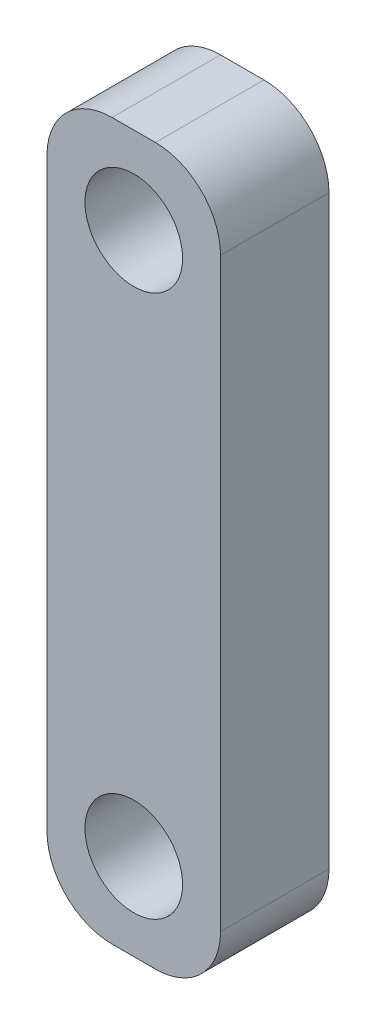
ISO-10303-21;
HEADER;
FILE_DESCRIPTION(('STEP AP214'),'2;1');
FILE_NAME('part.step','',(''),(''),'','','');
FILE_SCHEMA(('AUTOMOTIVE_DESIGN { 1 0 10303 214 1 1 1 1 }'));
ENDSEC;
DATA;
#1=APPLICATION_CONTEXT('core data for automotive mechanical design processes');
#2=APPLICATION_PROTOCOL_DEFINITION('international standard','automotive_design',2000,#1);
#3=PRODUCT_CONTEXT('',#1,'mechanical');
#4=PRODUCT('Part','Part','',(#3));
#5=PRODUCT_RELATED_PRODUCT_CATEGORY('part','',(#4));
#6=PRODUCT_DEFINITION_FORMATION('','',#4);
#7=PRODUCT_DEFINITION_CONTEXT('part definition',#1,'design');
#8=PRODUCT_DEFINITION('design','',#6,#7);
#9=PRODUCT_DEFINITION_SHAPE('','',#8);
#10=(LENGTH_UNIT() NAMED_UNIT(*) SI_UNIT(.MILLI.,.METRE.));
#11=(NAMED_UNIT(*) PLANE_ANGLE_UNIT() SI_UNIT($,.RADIAN.));
#12=(NAMED_UNIT(*) SI_UNIT($,.STERADIAN.) SOLID_ANGLE_UNIT());
#13=UNCERTAINTY_MEASURE_WITH_UNIT(LENGTH_MEASURE(1.E-05),#10,'distance_accuracy_value','');
#14=(GEOMETRIC_REPRESENTATION_CONTEXT(3) GLOBAL_UNCERTAINTY_ASSIGNED_CONTEXT((#13)) GLOBAL_UNIT_ASSIGNED_CONTEXT((#10,
#11,#12)) REPRESENTATION_CONTEXT('',''));
#15=CARTESIAN_POINT('',(0.,0.,0.));
#16=DIRECTION('',(0.,0.,1.));
#17=DIRECTION('',(1.,0.,0.));
#18=AXIS2_PLACEMENT_3D('',#15,#16,#17);
#19=CARTESIAN_POINT('',(0.,0.,5.));
#20=DIRECTION('',(0.,0.,1.));
#21=DIRECTION('',(1.,0.,0.));
#22=AXIS2_PLACEMENT_3D('',#19,#20,#21);
#23=PLANE('',#22);
#24=CARTESIAN_POINT('',(4.,-29.,5.));
#25=DIRECTION('',(0.,0.,1.));
#26=DIRECTION('',(1.,0.,0.));
#27=AXIS2_PLACEMENT_3D('',#24,#25,#26);
#28=CIRCLE('',#27,2.24999999999998);
#29=CARTESIAN_POINT('',(6.24999999999998,-29.,5.));
#30=VERTEX_POINT('',#29);
#31=EDGE_CURVE('E130',#30,#30,#28,.T.);
#32=ORIENTED_EDGE('',*,*,#31,.F.);
#33=EDGE_LOOP('',(#32));
#34=FACE_BOUND('',#33,.T.);
#35=DIRECTION('',(0.,-1.,0.));
#36=VECTOR('',#35,1.);
#37=CARTESIAN_POINT('',(0.,0.,5.));
#38=LINE('',#37,#36);
#39=CARTESIAN_POINT('',(0.,-3.,5.));
#40=VERTEX_POINT('',#39);
#41=CARTESIAN_POINT('',(0.,-30.,5.));
#42=VERTEX_POINT('',#41);
#43=EDGE_CURVE('E135',#40,#42,#38,.T.);
#44=ORIENTED_EDGE('',*,*,#43,.T.);
#45=CARTESIAN_POINT('',(3.,-30.,5.));
#46=DIRECTION('',(0.,0.,1.));
#47=DIRECTION('',(1.,0.,0.));
#48=AXIS2_PLACEMENT_3D('',#45,#46,#47);
#49=CIRCLE('',#48,3.);
#50=CARTESIAN_POINT('',(3.,-33.,5.));
#51=VERTEX_POINT('',#50);
#52=EDGE_CURVE('E150',#42,#51,#49,.T.);
#53=ORIENTED_EDGE('',*,*,#52,.T.);
#54=DIRECTION('',(1.,0.,0.));
#55=VECTOR('',#54,1.);
#56=CARTESIAN_POINT('',(0.,-33.,5.));
#57=LINE('',#56,#55);
#58=CARTESIAN_POINT('',(5.00000000000001,-33.,5.));
#59=VERTEX_POINT('',#58);
#60=EDGE_CURVE('E117',#51,#59,#57,.T.);
#61=ORIENTED_EDGE('',*,*,#60,.T.);
#62=CARTESIAN_POINT('',(5.00000000000001,-30.,5.));
#63=DIRECTION('',(0.,0.,1.));
#64=DIRECTION('',(1.,0.,0.));
#65=AXIS2_PLACEMENT_3D('',#62,#63,#64);
#66=CIRCLE('',#65,3.);
#67=CARTESIAN_POINT('',(8.00000000000001,-30.,5.));
#68=VERTEX_POINT('',#67);
#69=EDGE_CURVE('E148',#59,#68,#66,.T.);
#70=ORIENTED_EDGE('',*,*,#69,.T.);
#71=DIRECTION('',(0.,1.,0.));
#72=VECTOR('',#71,1.);
#73=CARTESIAN_POINT('',(8.00000000000001,0.,5.));
#74=LINE('',#73,#72);
#75=CARTESIAN_POINT('',(8.00000000000001,-3.,5.));
#76=VERTEX_POINT('',#75);
#77=EDGE_CURVE('E170',#68,#76,#74,.T.);
#78=ORIENTED_EDGE('',*,*,#77,.T.);
#79=CARTESIAN_POINT('',(5.00000000000001,-3.,5.));
#80=DIRECTION('',(0.,0.,1.));
#81=DIRECTION('',(1.,0.,0.));
#82=AXIS2_PLACEMENT_3D('',#79,#80,#81);
#83=CIRCLE('',#82,3.);
#84=CARTESIAN_POINT('',(5.00000000000001,0.,5.));
#85=VERTEX_POINT('',#84);
#86=EDGE_CURVE('E52',#76,#85,#83,.T.);
#87=ORIENTED_EDGE('',*,*,#86,.T.);
#88=DIRECTION('',(-1.,0.,0.));
#89=VECTOR('',#88,1.);
#90=CARTESIAN_POINT('',(0.,0.,5.));
#91=LINE('',#90,#89);
#92=CARTESIAN_POINT('',(3.,0.,5.));
#93=VERTEX_POINT('',#92);
#94=EDGE_CURVE('E136',#85,#93,#91,.T.);
#95=ORIENTED_EDGE('',*,*,#94,.T.);
#96=CARTESIAN_POINT('',(3.,-3.,5.));
#97=DIRECTION('',(0.,0.,1.));
#98=DIRECTION('',(1.,0.,0.));
#99=AXIS2_PLACEMENT_3D('',#96,#97,#98);
#100=CIRCLE('',#99,3.);
#101=EDGE_CURVE('E146',#93,#40,#100,.T.);
#102=ORIENTED_EDGE('',*,*,#101,.T.);
#103=EDGE_LOOP('',(#44,#53,#61,#70,#78,#87,#95,#102));
#104=FACE_BOUND('',#103,.T.);
#105=CARTESIAN_POINT('',(4.,-4.,5.));
#106=DIRECTION('',(0.,0.,1.));
#107=DIRECTION('',(1.,0.,0.));
#108=AXIS2_PLACEMENT_3D('',#105,#106,#107);
#109=CIRCLE('',#108,2.25);
#110=CARTESIAN_POINT('',(6.25,-4.,5.));
#111=VERTEX_POINT('',#110);
#112=EDGE_CURVE('E182',#111,#111,#109,.T.);
#113=ORIENTED_EDGE('',*,*,#112,.F.);
#114=EDGE_LOOP('',(#113));
#115=FACE_BOUND('',#114,.T.);
#116=ADVANCED_FACE('F32',(#34,#104,#115),#23,.T.);
#117=CARTESIAN_POINT('',(0.,0.,0.));
#118=DIRECTION('',(0.,0.,1.));
#119=DIRECTION('',(1.,0.,0.));
#120=AXIS2_PLACEMENT_3D('',#117,#118,#119);
#121=PLANE('',#120);
#122=CARTESIAN_POINT('',(4.,-29.,0.));
#123=DIRECTION('',(0.,0.,1.));
#124=DIRECTION('',(1.,0.,0.));
#125=AXIS2_PLACEMENT_3D('',#122,#123,#124);
#126=CIRCLE('',#125,2.24999999999998);
#127=CARTESIAN_POINT('',(6.24999999999998,-29.,0.));
#128=VERTEX_POINT('',#127);
#129=EDGE_CURVE('E173',#128,#128,#126,.T.);
#130=ORIENTED_EDGE('',*,*,#129,.T.);
#131=EDGE_LOOP('',(#130));
#132=FACE_BOUND('',#131,.T.);
#133=DIRECTION('',(1.,0.,0.));
#134=VECTOR('',#133,1.);
#135=CARTESIAN_POINT('',(0.,-33.,0.));
#136=LINE('',#135,#134);
#137=CARTESIAN_POINT('',(3.,-33.,0.));
#138=VERTEX_POINT('',#137);
#139=CARTESIAN_POINT('',(5.00000000000001,-33.,0.));
#140=VERTEX_POINT('',#139);
#141=EDGE_CURVE('E114',#138,#140,#136,.T.);
#142=ORIENTED_EDGE('',*,*,#141,.F.);
#143=CARTESIAN_POINT('',(3.,-30.,0.));
#144=DIRECTION('',(0.,0.,1.));
#145=DIRECTION('',(1.,0.,0.));
#146=AXIS2_PLACEMENT_3D('',#143,#144,#145);
#147=CIRCLE('',#146,3.);
#148=CARTESIAN_POINT('',(0.,-30.,0.));
#149=VERTEX_POINT('',#148);
#150=EDGE_CURVE('E97',#138,#149,#147,.F.);
#151=ORIENTED_EDGE('',*,*,#150,.T.);
#152=DIRECTION('',(0.,-1.,0.));
#153=VECTOR('',#152,1.);
#154=CARTESIAN_POINT('',(0.,0.,0.));
#155=LINE('',#154,#153);
#156=CARTESIAN_POINT('',(0.,-3.,0.));
#157=VERTEX_POINT('',#156);
#158=EDGE_CURVE('E125',#157,#149,#155,.T.);
#159=ORIENTED_EDGE('',*,*,#158,.F.);
#160=CARTESIAN_POINT('',(3.,-3.,0.));
#161=DIRECTION('',(0.,0.,1.));
#162=DIRECTION('',(1.,0.,0.));
#163=AXIS2_PLACEMENT_3D('',#160,#161,#162);
#164=CIRCLE('',#163,3.);
#165=CARTESIAN_POINT('',(3.,0.,0.));
#166=VERTEX_POINT('',#165);
#167=EDGE_CURVE('E139',#157,#166,#164,.F.);
#168=ORIENTED_EDGE('',*,*,#167,.T.);
#169=DIRECTION('',(-1.,0.,0.));
#170=VECTOR('',#169,1.);
#171=CARTESIAN_POINT('',(0.,0.,0.));
#172=LINE('',#171,#170);
#173=CARTESIAN_POINT('',(5.00000000000001,0.,0.));
#174=VERTEX_POINT('',#173);
#175=EDGE_CURVE('E128',#174,#166,#172,.T.);
#176=ORIENTED_EDGE('',*,*,#175,.F.);
#177=CARTESIAN_POINT('',(5.00000000000001,-3.,0.));
#178=DIRECTION('',(0.,0.,1.));
#179=DIRECTION('',(1.,0.,0.));
#180=AXIS2_PLACEMENT_3D('',#177,#178,#179);
#181=CIRCLE('',#180,3.);
#182=CARTESIAN_POINT('',(8.00000000000001,-3.,0.));
#183=VERTEX_POINT('',#182);
#184=EDGE_CURVE('E118',#174,#183,#181,.F.);
#185=ORIENTED_EDGE('',*,*,#184,.T.);
#186=DIRECTION('',(0.,1.,0.));
#187=VECTOR('',#186,1.);
#188=CARTESIAN_POINT('',(8.00000000000001,0.,0.));
#189=LINE('',#188,#187);
#190=CARTESIAN_POINT('',(8.00000000000001,-30.,0.));
#191=VERTEX_POINT('',#190);
#192=EDGE_CURVE('E124',#191,#183,#189,.T.);
#193=ORIENTED_EDGE('',*,*,#192,.F.);
#194=CARTESIAN_POINT('',(5.00000000000001,-30.,0.));
#195=DIRECTION('',(0.,0.,1.));
#196=DIRECTION('',(1.,0.,0.));
#197=AXIS2_PLACEMENT_3D('',#194,#195,#196);
#198=CIRCLE('',#197,3.);
#199=EDGE_CURVE('E108',#191,#140,#198,.F.);
#200=ORIENTED_EDGE('',*,*,#199,.T.);
#201=EDGE_LOOP('',(#142,#151,#159,#168,#176,#185,#193,#200));
#202=FACE_BOUND('',#201,.T.);
#203=CARTESIAN_POINT('',(4.,-4.,0.));
#204=DIRECTION('',(0.,0.,1.));
#205=DIRECTION('',(1.,0.,0.));
#206=AXIS2_PLACEMENT_3D('',#203,#204,#205);
#207=CIRCLE('',#206,2.25);
#208=CARTESIAN_POINT('',(6.25,-4.,0.));
#209=VERTEX_POINT('',#208);
#210=EDGE_CURVE('E184',#209,#209,#207,.T.);
#211=ORIENTED_EDGE('',*,*,#210,.T.);
#212=EDGE_LOOP('',(#211));
#213=FACE_BOUND('',#212,.T.);
#214=ADVANCED_FACE('F121',(#132,#202,#213),#121,.F.);
#215=CARTESIAN_POINT('',(0.,0.,5.));
#216=DIRECTION('',(1.,0.,0.));
#217=DIRECTION('',(0.,0.,-1.));
#218=AXIS2_PLACEMENT_3D('',#215,#216,#217);
#219=PLANE('',#218);
#220=ORIENTED_EDGE('',*,*,#158,.T.);
#221=DIRECTION('',(0.,0.,-1.));
#222=VECTOR('',#221,1.);
#223=CARTESIAN_POINT('',(0.,-30.,5.));
#224=LINE('',#223,#222);
#225=EDGE_CURVE('E102',#149,#42,#224,.F.);
#226=ORIENTED_EDGE('',*,*,#225,.T.);
#227=ORIENTED_EDGE('',*,*,#43,.F.);
#228=DIRECTION('',(0.,0.,-1.));
#229=VECTOR('',#228,1.);
#230=CARTESIAN_POINT('',(0.,-3.,5.));
#231=LINE('',#230,#229);
#232=EDGE_CURVE('E107',#40,#157,#231,.T.);
#233=ORIENTED_EDGE('',*,*,#232,.T.);
#234=EDGE_LOOP('',(#220,#226,#227,#233));
#235=FACE_BOUND('',#234,.T.);
#236=ADVANCED_FACE('F167',(#235),#219,.F.);
#237=CARTESIAN_POINT('',(0.,-33.,5.));
#238=DIRECTION('',(0.,1.,0.));
#239=DIRECTION('',(0.,0.,1.));
#240=AXIS2_PLACEMENT_3D('',#237,#238,#239);
#241=PLANE('',#240);
#242=ORIENTED_EDGE('',*,*,#60,.F.);
#243=DIRECTION('',(0.,0.,-1.));
#244=VECTOR('',#243,1.);
#245=CARTESIAN_POINT('',(3.,-33.,5.));
#246=LINE('',#245,#244);
#247=EDGE_CURVE('E101',#51,#138,#246,.T.);
#248=ORIENTED_EDGE('',*,*,#247,.T.);
#249=ORIENTED_EDGE('',*,*,#141,.T.);
#250=DIRECTION('',(0.,0.,-1.));
#251=VECTOR('',#250,1.);
#252=CARTESIAN_POINT('',(5.00000000000001,-33.,5.));
#253=LINE('',#252,#251);
#254=EDGE_CURVE('E119',#140,#59,#253,.F.);
#255=ORIENTED_EDGE('',*,*,#254,.T.);
#256=EDGE_LOOP('',(#242,#248,#249,#255));
#257=FACE_BOUND('',#256,.T.);
#258=ADVANCED_FACE('F113',(#257),#241,.F.);
#259=CARTESIAN_POINT('',(8.00000000000001,0.,5.));
#260=DIRECTION('',(-1.,0.,0.));
#261=DIRECTION('',(0.,0.,1.));
#262=AXIS2_PLACEMENT_3D('',#259,#260,#261);
#263=PLANE('',#262);
#264=ORIENTED_EDGE('',*,*,#77,.F.);
#265=DIRECTION('',(0.,0.,-1.));
#266=VECTOR('',#265,1.);
#267=CARTESIAN_POINT('',(8.00000000000001,-30.,5.));
#268=LINE('',#267,#266);
#269=EDGE_CURVE('E154',#68,#191,#268,.T.);
#270=ORIENTED_EDGE('',*,*,#269,.T.);
#271=ORIENTED_EDGE('',*,*,#192,.T.);
#272=DIRECTION('',(0.,0.,-1.));
#273=VECTOR('',#272,1.);
#274=CARTESIAN_POINT('',(8.00000000000001,-3.,5.));
#275=LINE('',#274,#273);
#276=EDGE_CURVE('E152',#183,#76,#275,.F.);
#277=ORIENTED_EDGE('',*,*,#276,.T.);
#278=EDGE_LOOP('',(#264,#270,#271,#277));
#279=FACE_BOUND('',#278,.T.);
#280=ADVANCED_FACE('F208',(#279),#263,.F.);
#281=CARTESIAN_POINT('',(0.,0.,5.));
#282=DIRECTION('',(0.,-1.,0.));
#283=DIRECTION('',(0.,0.,-1.));
#284=AXIS2_PLACEMENT_3D('',#281,#282,#283);
#285=PLANE('',#284);
#286=ORIENTED_EDGE('',*,*,#175,.T.);
#287=DIRECTION('',(0.,0.,-1.));
#288=VECTOR('',#287,1.);
#289=CARTESIAN_POINT('',(3.,0.,5.));
#290=LINE('',#289,#288);
#291=EDGE_CURVE('E11',#166,#93,#290,.F.);
#292=ORIENTED_EDGE('',*,*,#291,.T.);
#293=ORIENTED_EDGE('',*,*,#94,.F.);
#294=DIRECTION('',(0.,0.,-1.));
#295=VECTOR('',#294,1.);
#296=CARTESIAN_POINT('',(5.00000000000001,0.,5.));
#297=LINE('',#296,#295);
#298=EDGE_CURVE('E40',#85,#174,#297,.T.);
#299=ORIENTED_EDGE('',*,*,#298,.T.);
#300=EDGE_LOOP('',(#286,#292,#293,#299));
#301=FACE_BOUND('',#300,.T.);
#302=ADVANCED_FACE('F159',(#301),#285,.F.);
#303=CARTESIAN_POINT('',(4.,-29.,5.));
#304=DIRECTION('',(0.,0.,-1.));
#305=DIRECTION('',(-1.,0.,0.));
#306=AXIS2_PLACEMENT_3D('',#303,#304,#305);
#307=CYLINDRICAL_SURFACE('',#306,2.24999999999998);
#308=ORIENTED_EDGE('',*,*,#31,.T.);
#309=EDGE_LOOP('',(#308));
#310=FACE_BOUND('',#309,.T.);
#311=ORIENTED_EDGE('',*,*,#129,.F.);
#312=EDGE_LOOP('',(#311));
#313=FACE_BOUND('',#312,.T.);
#314=ADVANCED_FACE('F192',(#310,#313),#307,.F.);
#315=CARTESIAN_POINT('',(4.,-4.,5.));
#316=DIRECTION('',(0.,0.,-1.));
#317=DIRECTION('',(-1.,0.,0.));
#318=AXIS2_PLACEMENT_3D('',#315,#316,#317);
#319=CYLINDRICAL_SURFACE('',#318,2.25);
#320=ORIENTED_EDGE('',*,*,#112,.T.);
#321=EDGE_LOOP('',(#320));
#322=FACE_BOUND('',#321,.T.);
#323=ORIENTED_EDGE('',*,*,#210,.F.);
#324=EDGE_LOOP('',(#323));
#325=FACE_BOUND('',#324,.T.);
#326=ADVANCED_FACE('F195',(#322,#325),#319,.F.);
#327=CARTESIAN_POINT('',(3.,-30.,5.));
#328=DIRECTION('',(0.,0.,-1.));
#329=DIRECTION('',(-1.,0.,0.));
#330=AXIS2_PLACEMENT_3D('',#327,#328,#329);
#331=CYLINDRICAL_SURFACE('',#330,3.);
#332=ORIENTED_EDGE('',*,*,#52,.F.);
#333=ORIENTED_EDGE('',*,*,#225,.F.);
#334=ORIENTED_EDGE('',*,*,#150,.F.);
#335=ORIENTED_EDGE('',*,*,#247,.F.);
#336=EDGE_LOOP('',(#332,#333,#334,#335));
#337=FACE_BOUND('',#336,.T.);
#338=ADVANCED_FACE('F100',(#337),#331,.T.);
#339=CARTESIAN_POINT('',(5.00000000000001,-30.,5.));
#340=DIRECTION('',(0.,0.,-1.));
#341=DIRECTION('',(-1.,0.,0.));
#342=AXIS2_PLACEMENT_3D('',#339,#340,#341);
#343=CYLINDRICAL_SURFACE('',#342,3.);
#344=ORIENTED_EDGE('',*,*,#69,.F.);
#345=ORIENTED_EDGE('',*,*,#254,.F.);
#346=ORIENTED_EDGE('',*,*,#199,.F.);
#347=ORIENTED_EDGE('',*,*,#269,.F.);
#348=EDGE_LOOP('',(#344,#345,#346,#347));
#349=FACE_BOUND('',#348,.T.);
#350=ADVANCED_FACE('F216',(#349),#343,.T.);
#351=CARTESIAN_POINT('',(3.,-3.,5.));
#352=DIRECTION('',(0.,0.,-1.));
#353=DIRECTION('',(-1.,0.,0.));
#354=AXIS2_PLACEMENT_3D('',#351,#352,#353);
#355=CYLINDRICAL_SURFACE('',#354,3.);
#356=ORIENTED_EDGE('',*,*,#101,.F.);
#357=ORIENTED_EDGE('',*,*,#291,.F.);
#358=ORIENTED_EDGE('',*,*,#167,.F.);
#359=ORIENTED_EDGE('',*,*,#232,.F.);
#360=EDGE_LOOP('',(#356,#357,#358,#359));
#361=FACE_BOUND('',#360,.T.);
#362=ADVANCED_FACE('F164',(#361),#355,.T.);
#363=CARTESIAN_POINT('',(5.00000000000001,-3.,5.));
#364=DIRECTION('',(0.,0.,-1.));
#365=DIRECTION('',(-1.,0.,0.));
#366=AXIS2_PLACEMENT_3D('',#363,#364,#365);
#367=CYLINDRICAL_SURFACE('',#366,3.);
#368=ORIENTED_EDGE('',*,*,#86,.F.);
#369=ORIENTED_EDGE('',*,*,#276,.F.);
#370=ORIENTED_EDGE('',*,*,#184,.F.);
#371=ORIENTED_EDGE('',*,*,#298,.F.);
#372=EDGE_LOOP('',(#368,#369,#370,#371));
#373=FACE_BOUND('',#372,.T.);
#374=ADVANCED_FACE('F34',(#373),#367,.T.);
#375=CLOSED_SHELL('',(#116,#214,#236,#258,#280,#302,#314,#326,#338,#350,#362,#374));
#376=MANIFOLD_SOLID_BREP('B2',#375);
#377=ADVANCED_BREP_SHAPE_REPRESENTATION('',(#18,#376),#14);
#378=SHAPE_DEFINITION_REPRESENTATION(#9,#377);
ENDSEC;
END-ISO-10303-21;
